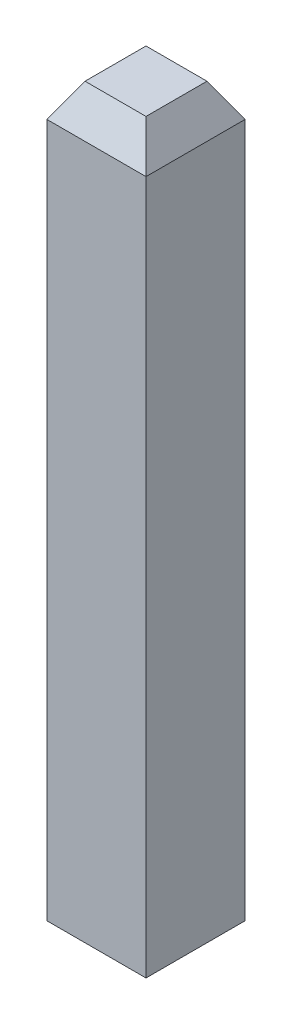
ISO-10303-21;
HEADER;
FILE_DESCRIPTION(('STEP AP214'),'2;1');
FILE_NAME('part.step','',(''),(''),'','','');
FILE_SCHEMA(('AUTOMOTIVE_DESIGN { 1 0 10303 214 1 1 1 1 }'));
ENDSEC;
DATA;
#1=APPLICATION_CONTEXT('core data for automotive mechanical design processes');
#2=APPLICATION_PROTOCOL_DEFINITION('international standard','automotive_design',2000,#1);
#3=PRODUCT_CONTEXT('',#1,'mechanical');
#4=PRODUCT('Part','Part','',(#3));
#5=PRODUCT_RELATED_PRODUCT_CATEGORY('part','',(#4));
#6=PRODUCT_DEFINITION_FORMATION('','',#4);
#7=PRODUCT_DEFINITION_CONTEXT('part definition',#1,'design');
#8=PRODUCT_DEFINITION('design','',#6,#7);
#9=PRODUCT_DEFINITION_SHAPE('','',#8);
#10=(LENGTH_UNIT() NAMED_UNIT(*) SI_UNIT(.MILLI.,.METRE.));
#11=(NAMED_UNIT(*) PLANE_ANGLE_UNIT() SI_UNIT($,.RADIAN.));
#12=(NAMED_UNIT(*) SI_UNIT($,.STERADIAN.) SOLID_ANGLE_UNIT());
#13=UNCERTAINTY_MEASURE_WITH_UNIT(LENGTH_MEASURE(1.E-05),#10,'distance_accuracy_value','');
#14=(GEOMETRIC_REPRESENTATION_CONTEXT(3) GLOBAL_UNCERTAINTY_ASSIGNED_CONTEXT((#13)) GLOBAL_UNIT_ASSIGNED_CONTEXT((#10,
#11,#12)) REPRESENTATION_CONTEXT('',''));
#15=CARTESIAN_POINT('',(0.,0.,0.));
#16=DIRECTION('',(0.,0.,1.));
#17=DIRECTION('',(1.,0.,0.));
#18=AXIS2_PLACEMENT_3D('',#15,#16,#17);
#19=CARTESIAN_POINT('',(-2.72452994616208,6.1,0.));
#20=DIRECTION('',(-0.866025403784439,0.5,0.));
#21=DIRECTION('',(-0.5,-0.866025403784439,0.));
#22=AXIS2_PLACEMENT_3D('',#19,#20,#21);
#23=PLANE('',#22);
#24=DIRECTION('',(-0.447213595499943,-0.77459666924149,0.447213595499962));
#25=VECTOR('',#24,1.);
#26=CARTESIAN_POINT('',(-2.72452994616208,6.1,0.734529946162076));
#27=LINE('',#26,#25);
#28=CARTESIAN_POINT('',(-2.72452994616208,6.1,0.734529946162076));
#29=VERTEX_POINT('',#28);
#30=CARTESIAN_POINT('',(-2.84,5.9,0.850000000000001));
#31=VERTEX_POINT('',#30);
#32=EDGE_CURVE('E20',#29,#31,#27,.T.);
#33=ORIENTED_EDGE('',*,*,#32,.F.);
#34=DIRECTION('',(0.,0.,1.));
#35=VECTOR('',#34,1.);
#36=CARTESIAN_POINT('',(-2.72452994616208,6.1,0.));
#37=LINE('',#36,#35);
#38=CARTESIAN_POINT('',(-2.72452994616208,6.1,0.365470053837926));
#39=VERTEX_POINT('',#38);
#40=EDGE_CURVE('E72',#39,#29,#37,.T.);
#41=ORIENTED_EDGE('',*,*,#40,.F.);
#42=DIRECTION('',(0.447213595499943,0.77459666924149,0.447213595499962));
#43=VECTOR('',#42,1.);
#44=CARTESIAN_POINT('',(-2.84,5.9,0.250000000000002));
#45=LINE('',#44,#43);
#46=CARTESIAN_POINT('',(-2.84,5.9,0.250000000000001));
#47=VERTEX_POINT('',#46);
#48=EDGE_CURVE('E66',#47,#39,#45,.T.);
#49=ORIENTED_EDGE('',*,*,#48,.F.);
#50=DIRECTION('',(0.,0.,-1.));
#51=VECTOR('',#50,1.);
#52=CARTESIAN_POINT('',(-2.84,5.9,0.250000000000001));
#53=LINE('',#52,#51);
#54=EDGE_CURVE('E74',#47,#31,#53,.F.);
#55=ORIENTED_EDGE('',*,*,#54,.T.);
#56=EDGE_LOOP('',(#33,#41,#49,#55));
#57=FACE_BOUND('',#56,.T.);
#58=ADVANCED_FACE('F17',(#57),#23,.T.);
#59=CARTESIAN_POINT('',(0.,6.1,0.734529946162076));
#60=DIRECTION('',(0.,0.5,0.866025403784439));
#61=DIRECTION('',(0.,-0.866025403784439,0.5));
#62=AXIS2_PLACEMENT_3D('',#59,#60,#61);
#63=PLANE('',#62);
#64=DIRECTION('',(0.447213595499958,-0.774596669241485,0.447213595499955));
#65=VECTOR('',#64,1.);
#66=CARTESIAN_POINT('',(-2.35547005383793,6.1,0.734529946162076));
#67=LINE('',#66,#65);
#68=CARTESIAN_POINT('',(-2.35547005383793,6.1,0.734529946162076));
#69=VERTEX_POINT('',#68);
#70=CARTESIAN_POINT('',(-2.24,5.9,0.850000000000001));
#71=VERTEX_POINT('',#70);
#72=EDGE_CURVE('E88',#69,#71,#67,.T.);
#73=ORIENTED_EDGE('',*,*,#72,.F.);
#74=DIRECTION('',(1.,0.,0.));
#75=VECTOR('',#74,1.);
#76=CARTESIAN_POINT('',(0.,6.1,0.734529946162076));
#77=LINE('',#76,#75);
#78=EDGE_CURVE('E79',#29,#69,#77,.T.);
#79=ORIENTED_EDGE('',*,*,#78,.F.);
#80=ORIENTED_EDGE('',*,*,#32,.T.);
#81=DIRECTION('',(-1.,0.,0.));
#82=VECTOR('',#81,1.);
#83=CARTESIAN_POINT('',(-2.84,5.9,0.850000000000001));
#84=LINE('',#83,#82);
#85=EDGE_CURVE('E101',#31,#71,#84,.F.);
#86=ORIENTED_EDGE('',*,*,#85,.T.);
#87=EDGE_LOOP('',(#73,#79,#80,#86));
#88=FACE_BOUND('',#87,.T.);
#89=ADVANCED_FACE('F87',(#88),#63,.T.);
#90=CARTESIAN_POINT('',(0.,6.1,0.));
#91=DIRECTION('',(0.,1.,0.));
#92=DIRECTION('',(0.,0.,1.));
#93=AXIS2_PLACEMENT_3D('',#90,#91,#92);
#94=PLANE('',#93);
#95=DIRECTION('',(1.,0.,0.));
#96=VECTOR('',#95,1.);
#97=CARTESIAN_POINT('',(0.,6.1,0.365470053837926));
#98=LINE('',#97,#96);
#99=CARTESIAN_POINT('',(-2.35547005383793,6.1,0.365470053837926));
#100=VERTEX_POINT('',#99);
#101=EDGE_CURVE('E84',#39,#100,#98,.T.);
#102=ORIENTED_EDGE('',*,*,#101,.F.);
#103=ORIENTED_EDGE('',*,*,#40,.T.);
#104=ORIENTED_EDGE('',*,*,#78,.T.);
#105=DIRECTION('',(0.,0.,1.));
#106=VECTOR('',#105,1.);
#107=CARTESIAN_POINT('',(-2.35547005383793,6.1,0.));
#108=LINE('',#107,#106);
#109=EDGE_CURVE('E107',#100,#69,#108,.T.);
#110=ORIENTED_EDGE('',*,*,#109,.F.);
#111=EDGE_LOOP('',(#102,#103,#104,#110));
#112=FACE_BOUND('',#111,.T.);
#113=ADVANCED_FACE('F81',(#112),#94,.T.);
#114=CARTESIAN_POINT('',(0.,6.1,0.365470053837926));
#115=DIRECTION('',(0.,0.5,-0.866025403784439));
#116=DIRECTION('',(0.,0.866025403784439,0.5));
#117=AXIS2_PLACEMENT_3D('',#114,#115,#116);
#118=PLANE('',#117);
#119=DIRECTION('',(-0.447213595499958,0.774596669241485,0.447213595499955));
#120=VECTOR('',#119,1.);
#121=CARTESIAN_POINT('',(-2.24,5.9,0.250000000000001));
#122=LINE('',#121,#120);
#123=CARTESIAN_POINT('',(-2.24,5.9,0.250000000000001));
#124=VERTEX_POINT('',#123);
#125=EDGE_CURVE('E104',#124,#100,#122,.T.);
#126=ORIENTED_EDGE('',*,*,#125,.F.);
#127=DIRECTION('',(1.,0.,0.));
#128=VECTOR('',#127,1.);
#129=CARTESIAN_POINT('',(-2.84,5.9,0.250000000000001));
#130=LINE('',#129,#128);
#131=EDGE_CURVE('E34',#124,#47,#130,.F.);
#132=ORIENTED_EDGE('',*,*,#131,.T.);
#133=ORIENTED_EDGE('',*,*,#48,.T.);
#134=ORIENTED_EDGE('',*,*,#101,.T.);
#135=EDGE_LOOP('',(#126,#132,#133,#134));
#136=FACE_BOUND('',#135,.T.);
#137=ADVANCED_FACE('F154',(#136),#118,.T.);
#138=CARTESIAN_POINT('',(-2.84,6.1,0.250000000000001));
#139=DIRECTION('',(1.,0.,0.));
#140=DIRECTION('',(0.,0.,-1.));
#141=AXIS2_PLACEMENT_3D('',#138,#139,#140);
#142=PLANE('',#141);
#143=ORIENTED_EDGE('',*,*,#54,.F.);
#144=DIRECTION('',(0.,1.,0.));
#145=VECTOR('',#144,1.);
#146=CARTESIAN_POINT('',(-2.84,6.1,0.250000000000001));
#147=LINE('',#146,#145);
#148=CARTESIAN_POINT('',(-2.84,1.7,0.250000000000001));
#149=VERTEX_POINT('',#148);
#150=EDGE_CURVE('E113',#47,#149,#147,.F.);
#151=ORIENTED_EDGE('',*,*,#150,.T.);
#152=DIRECTION('',(0.,0.,1.));
#153=VECTOR('',#152,1.);
#154=CARTESIAN_POINT('',(-2.84,1.7,0.));
#155=LINE('',#154,#153);
#156=CARTESIAN_POINT('',(-2.84,1.7,0.850000000000001));
#157=VERTEX_POINT('',#156);
#158=EDGE_CURVE('E93',#149,#157,#155,.T.);
#159=ORIENTED_EDGE('',*,*,#158,.T.);
#160=DIRECTION('',(0.,1.,0.));
#161=VECTOR('',#160,1.);
#162=CARTESIAN_POINT('',(-2.84,6.1,0.850000000000001));
#163=LINE('',#162,#161);
#164=EDGE_CURVE('E98',#157,#31,#163,.T.);
#165=ORIENTED_EDGE('',*,*,#164,.T.);
#166=EDGE_LOOP('',(#143,#151,#159,#165));
#167=FACE_BOUND('',#166,.T.);
#168=ADVANCED_FACE('F151',(#167),#142,.F.);
#169=CARTESIAN_POINT('',(0.,1.7,0.));
#170=DIRECTION('',(0.,1.,0.));
#171=DIRECTION('',(0.,0.,1.));
#172=AXIS2_PLACEMENT_3D('',#169,#170,#171);
#173=PLANE('',#172);
#174=DIRECTION('',(-1.,0.,0.));
#175=VECTOR('',#174,1.);
#176=CARTESIAN_POINT('',(-2.84,1.7,0.850000000000001));
#177=LINE('',#176,#175);
#178=CARTESIAN_POINT('',(-2.24,1.7,0.850000000000001));
#179=VERTEX_POINT('',#178);
#180=EDGE_CURVE('E95',#179,#157,#177,.T.);
#181=ORIENTED_EDGE('',*,*,#180,.T.);
#182=ORIENTED_EDGE('',*,*,#158,.F.);
#183=DIRECTION('',(1.,0.,0.));
#184=VECTOR('',#183,1.);
#185=CARTESIAN_POINT('',(-2.84,1.7,0.250000000000001));
#186=LINE('',#185,#184);
#187=CARTESIAN_POINT('',(-2.24,1.7,0.250000000000001));
#188=VERTEX_POINT('',#187);
#189=EDGE_CURVE('E109',#149,#188,#186,.T.);
#190=ORIENTED_EDGE('',*,*,#189,.T.);
#191=DIRECTION('',(0.,0.,1.));
#192=VECTOR('',#191,1.);
#193=CARTESIAN_POINT('',(-2.24,1.7,0.250000000000001));
#194=LINE('',#193,#192);
#195=EDGE_CURVE('E116',#188,#179,#194,.T.);
#196=ORIENTED_EDGE('',*,*,#195,.T.);
#197=EDGE_LOOP('',(#181,#182,#190,#196));
#198=FACE_BOUND('',#197,.T.);
#199=ADVANCED_FACE('F134',(#198),#173,.F.);
#200=CARTESIAN_POINT('',(-2.84,6.1,0.850000000000001));
#201=DIRECTION('',(0.,0.,-1.));
#202=DIRECTION('',(-1.,0.,0.));
#203=AXIS2_PLACEMENT_3D('',#200,#201,#202);
#204=PLANE('',#203);
#205=ORIENTED_EDGE('',*,*,#85,.F.);
#206=ORIENTED_EDGE('',*,*,#164,.F.);
#207=ORIENTED_EDGE('',*,*,#180,.F.);
#208=DIRECTION('',(0.,1.,0.));
#209=VECTOR('',#208,1.);
#210=CARTESIAN_POINT('',(-2.24,6.1,0.850000000000001));
#211=LINE('',#210,#209);
#212=EDGE_CURVE('E119',#179,#71,#211,.T.);
#213=ORIENTED_EDGE('',*,*,#212,.T.);
#214=EDGE_LOOP('',(#205,#206,#207,#213));
#215=FACE_BOUND('',#214,.T.);
#216=ADVANCED_FACE('F131',(#215),#204,.F.);
#217=CARTESIAN_POINT('',(-2.35547005383793,6.1,0.));
#218=DIRECTION('',(0.866025403784439,0.5,0.));
#219=DIRECTION('',(-0.5,0.866025403784439,0.));
#220=AXIS2_PLACEMENT_3D('',#217,#218,#219);
#221=PLANE('',#220);
#222=ORIENTED_EDGE('',*,*,#125,.T.);
#223=ORIENTED_EDGE('',*,*,#109,.T.);
#224=ORIENTED_EDGE('',*,*,#72,.T.);
#225=DIRECTION('',(0.,0.,1.));
#226=VECTOR('',#225,1.);
#227=CARTESIAN_POINT('',(-2.24,5.9,0.250000000000001));
#228=LINE('',#227,#226);
#229=EDGE_CURVE('E26',#71,#124,#228,.F.);
#230=ORIENTED_EDGE('',*,*,#229,.T.);
#231=EDGE_LOOP('',(#222,#223,#224,#230));
#232=FACE_BOUND('',#231,.T.);
#233=ADVANCED_FACE('F125',(#232),#221,.T.);
#234=CARTESIAN_POINT('',(-2.84,6.1,0.250000000000001));
#235=DIRECTION('',(0.,0.,1.));
#236=DIRECTION('',(1.,0.,0.));
#237=AXIS2_PLACEMENT_3D('',#234,#235,#236);
#238=PLANE('',#237);
#239=ORIENTED_EDGE('',*,*,#131,.F.);
#240=DIRECTION('',(0.,1.,0.));
#241=VECTOR('',#240,1.);
#242=CARTESIAN_POINT('',(-2.24,6.1,0.250000000000001));
#243=LINE('',#242,#241);
#244=EDGE_CURVE('E11',#124,#188,#243,.F.);
#245=ORIENTED_EDGE('',*,*,#244,.T.);
#246=ORIENTED_EDGE('',*,*,#189,.F.);
#247=ORIENTED_EDGE('',*,*,#150,.F.);
#248=EDGE_LOOP('',(#239,#245,#246,#247));
#249=FACE_BOUND('',#248,.T.);
#250=ADVANCED_FACE('F136',(#249),#238,.F.);
#251=CARTESIAN_POINT('',(-2.24,6.1,0.250000000000001));
#252=DIRECTION('',(-1.,0.,0.));
#253=DIRECTION('',(0.,0.,1.));
#254=AXIS2_PLACEMENT_3D('',#251,#252,#253);
#255=PLANE('',#254);
#256=ORIENTED_EDGE('',*,*,#229,.F.);
#257=ORIENTED_EDGE('',*,*,#212,.F.);
#258=ORIENTED_EDGE('',*,*,#195,.F.);
#259=ORIENTED_EDGE('',*,*,#244,.F.);
#260=EDGE_LOOP('',(#256,#257,#258,#259));
#261=FACE_BOUND('',#260,.T.);
#262=ADVANCED_FACE('F129',(#261),#255,.F.);
#263=CLOSED_SHELL('',(#58,#89,#113,#137,#168,#199,#216,#233,#250,#262));
#264=MANIFOLD_SOLID_BREP('B1',#263);
#265=ADVANCED_BREP_SHAPE_REPRESENTATION('',(#18,#264),#14);
#266=SHAPE_DEFINITION_REPRESENTATION(#9,#265);
ENDSEC;
END-ISO-10303-21;
